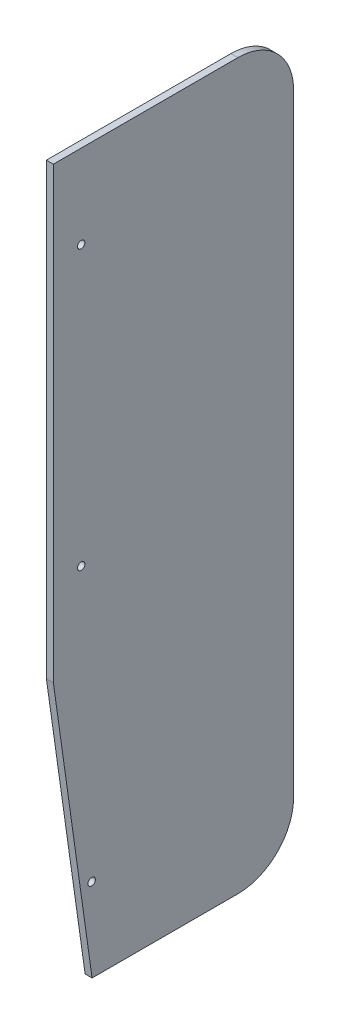
ISO-10303-21;
HEADER;
FILE_DESCRIPTION(('STEP AP214'),'2;1');
FILE_NAME('part.step','',(''),(''),'','','');
FILE_SCHEMA(('AUTOMOTIVE_DESIGN { 1 0 10303 214 1 1 1 1 }'));
ENDSEC;
DATA;
#1=APPLICATION_CONTEXT('core data for automotive mechanical design processes');
#2=APPLICATION_PROTOCOL_DEFINITION('international standard','automotive_design',2000,#1);
#3=PRODUCT_CONTEXT('',#1,'mechanical');
#4=PRODUCT('Part','Part','',(#3));
#5=PRODUCT_RELATED_PRODUCT_CATEGORY('part','',(#4));
#6=PRODUCT_DEFINITION_FORMATION('','',#4);
#7=PRODUCT_DEFINITION_CONTEXT('part definition',#1,'design');
#8=PRODUCT_DEFINITION('design','',#6,#7);
#9=PRODUCT_DEFINITION_SHAPE('','',#8);
#10=(LENGTH_UNIT() NAMED_UNIT(*) SI_UNIT(.MILLI.,.METRE.));
#11=(NAMED_UNIT(*) PLANE_ANGLE_UNIT() SI_UNIT($,.RADIAN.));
#12=(NAMED_UNIT(*) SI_UNIT($,.STERADIAN.) SOLID_ANGLE_UNIT());
#13=UNCERTAINTY_MEASURE_WITH_UNIT(LENGTH_MEASURE(1.E-05),#10,'distance_accuracy_value','');
#14=(GEOMETRIC_REPRESENTATION_CONTEXT(3) GLOBAL_UNCERTAINTY_ASSIGNED_CONTEXT((#13)) GLOBAL_UNIT_ASSIGNED_CONTEXT((#10,
#11,#12)) REPRESENTATION_CONTEXT('',''));
#15=CARTESIAN_POINT('',(0.,0.,0.));
#16=DIRECTION('',(0.,0.,1.));
#17=DIRECTION('',(1.,0.,0.));
#18=AXIS2_PLACEMENT_3D('',#15,#16,#17);
#19=CARTESIAN_POINT('',(0.,0.,0.));
#20=DIRECTION('',(1.,0.,0.));
#21=DIRECTION('',(0.,0.,-1.));
#22=AXIS2_PLACEMENT_3D('',#19,#20,#21);
#23=PLANE('',#22);
#24=CARTESIAN_POINT('',(0.,-76.2,-25.4));
#25=DIRECTION('',(1.,0.,0.));
#26=DIRECTION('',(0.,0.,-1.));
#27=AXIS2_PLACEMENT_3D('',#24,#25,#26);
#28=CIRCLE('',#27,3.3655);
#29=CARTESIAN_POINT('',(0.,-76.2,-28.7655));
#30=VERTEX_POINT('',#29);
#31=EDGE_CURVE('E144',#30,#30,#28,.T.);
#32=ORIENTED_EDGE('',*,*,#31,.T.);
#33=EDGE_LOOP('',(#32));
#34=FACE_BOUND('',#33,.T.);
#35=CARTESIAN_POINT('',(0.,-584.2,-34.925));
#36=DIRECTION('',(1.,0.,0.));
#37=DIRECTION('',(0.,0.,-1.));
#38=AXIS2_PLACEMENT_3D('',#35,#36,#37);
#39=CIRCLE('',#38,3.3655);
#40=CARTESIAN_POINT('',(0.,-584.2,-38.2905));
#41=VERTEX_POINT('',#40);
#42=EDGE_CURVE('E147',#41,#41,#39,.T.);
#43=ORIENTED_EDGE('',*,*,#42,.T.);
#44=EDGE_LOOP('',(#43));
#45=FACE_BOUND('',#44,.T.);
#46=CARTESIAN_POINT('',(0.,-330.2,-25.4));
#47=DIRECTION('',(1.,0.,0.));
#48=DIRECTION('',(0.,0.,-1.));
#49=AXIS2_PLACEMENT_3D('',#46,#47,#48);
#50=CIRCLE('',#49,3.3655);
#51=CARTESIAN_POINT('',(0.,-330.2,-28.7655));
#52=VERTEX_POINT('',#51);
#53=EDGE_CURVE('E121',#52,#52,#50,.T.);
#54=ORIENTED_EDGE('',*,*,#53,.T.);
#55=EDGE_LOOP('',(#54));
#56=FACE_BOUND('',#55,.T.);
#57=DIRECTION('',(0.,0.,1.));
#58=VECTOR('',#57,1.);
#59=CARTESIAN_POINT('',(0.,0.,-219.075));
#60=LINE('',#59,#58);
#61=CARTESIAN_POINT('',(0.,0.,-168.275));
#62=VERTEX_POINT('',#61);
#63=CARTESIAN_POINT('',(0.,0.,0.));
#64=VERTEX_POINT('',#63);
#65=EDGE_CURVE('E124',#62,#64,#60,.T.);
#66=ORIENTED_EDGE('',*,*,#65,.F.);
#67=CARTESIAN_POINT('',(0.,-50.8,-168.275));
#68=DIRECTION('',(-1.,0.,0.));
#69=DIRECTION('',(0.,0.,1.));
#70=AXIS2_PLACEMENT_3D('',#67,#68,#69);
#71=CIRCLE('',#70,50.8);
#72=CARTESIAN_POINT('',(0.,-50.8,-219.075));
#73=VERTEX_POINT('',#72);
#74=EDGE_CURVE('E81',#73,#62,#71,.F.);
#75=ORIENTED_EDGE('',*,*,#74,.F.);
#76=DIRECTION('',(0.,1.,0.));
#77=VECTOR('',#76,1.);
#78=CARTESIAN_POINT('',(0.,-660.4,-219.075));
#79=LINE('',#78,#77);
#80=CARTESIAN_POINT('',(0.,-609.6,-219.075));
#81=VERTEX_POINT('',#80);
#82=EDGE_CURVE('E77',#81,#73,#79,.T.);
#83=ORIENTED_EDGE('',*,*,#82,.F.);
#84=CARTESIAN_POINT('',(0.,-609.6,-168.275));
#85=DIRECTION('',(-1.,0.,0.));
#86=DIRECTION('',(0.,0.,1.));
#87=AXIS2_PLACEMENT_3D('',#84,#85,#86);
#88=CIRCLE('',#87,50.8);
#89=CARTESIAN_POINT('',(0.,-660.4,-168.275));
#90=VERTEX_POINT('',#89);
#91=EDGE_CURVE('E20',#90,#81,#88,.F.);
#92=ORIENTED_EDGE('',*,*,#91,.F.);
#93=DIRECTION('',(0.,0.,-1.));
#94=VECTOR('',#93,1.);
#95=CARTESIAN_POINT('',(0.,-660.4,0.));
#96=LINE('',#95,#94);
#97=CARTESIAN_POINT('',(0.,-660.4,-35.3059999999987));
#98=VERTEX_POINT('',#97);
#99=EDGE_CURVE('E72',#98,#90,#96,.T.);
#100=ORIENTED_EDGE('',*,*,#99,.F.);
#101=DIRECTION('',(0.,-0.990238204862478,-0.139385428329997));
#102=VECTOR('',#101,1.);
#103=CARTESIAN_POINT('',(0.,-534.9875,-17.653));
#104=LINE('',#103,#102);
#105=CARTESIAN_POINT('',(0.,-409.575,-3.92047505570758E-13));
#106=VERTEX_POINT('',#105);
#107=EDGE_CURVE('E118',#106,#98,#104,.T.);
#108=ORIENTED_EDGE('',*,*,#107,.F.);
#109=DIRECTION('',(0.,1.,0.));
#110=VECTOR('',#109,1.);
#111=CARTESIAN_POINT('',(0.,0.,0.));
#112=LINE('',#111,#110);
#113=EDGE_CURVE('E105',#64,#106,#112,.F.);
#114=ORIENTED_EDGE('',*,*,#113,.F.);
#115=EDGE_LOOP('',(#66,#75,#83,#92,#100,#108,#114));
#116=FACE_BOUND('',#115,.T.);
#117=ADVANCED_FACE('F17',(#34,#45,#56,#116),#23,.F.);
#118=CARTESIAN_POINT('',(0.,-660.4,0.));
#119=DIRECTION('',(0.,-1.,0.));
#120=DIRECTION('',(0.,0.,-1.));
#121=AXIS2_PLACEMENT_3D('',#118,#119,#120);
#122=PLANE('',#121);
#123=DIRECTION('',(0.,0.,-1.));
#124=VECTOR('',#123,1.);
#125=CARTESIAN_POINT('',(6.35,-660.4,0.));
#126=LINE('',#125,#124);
#127=CARTESIAN_POINT('',(6.35,-660.4,-35.3059999999995));
#128=VERTEX_POINT('',#127);
#129=CARTESIAN_POINT('',(6.35,-660.4,-168.275));
#130=VERTEX_POINT('',#129);
#131=EDGE_CURVE('E143',#128,#130,#126,.T.);
#132=ORIENTED_EDGE('',*,*,#131,.F.);
#133=DIRECTION('',(1.,0.,0.));
#134=VECTOR('',#133,1.);
#135=CARTESIAN_POINT('',(3.175,-660.4,-35.3059999999984));
#136=LINE('',#135,#134);
#137=EDGE_CURVE('E102',#98,#128,#136,.T.);
#138=ORIENTED_EDGE('',*,*,#137,.F.);
#139=ORIENTED_EDGE('',*,*,#99,.T.);
#140=DIRECTION('',(-1.,0.,0.));
#141=VECTOR('',#140,1.);
#142=CARTESIAN_POINT('',(68.07454,-660.4,-168.275));
#143=LINE('',#142,#141);
#144=EDGE_CURVE('E91',#130,#90,#143,.T.);
#145=ORIENTED_EDGE('',*,*,#144,.F.);
#146=EDGE_LOOP('',(#132,#138,#139,#145));
#147=FACE_BOUND('',#146,.T.);
#148=ADVANCED_FACE('F179',(#147),#122,.T.);
#149=CARTESIAN_POINT('',(68.07454,-609.6,-168.275));
#150=DIRECTION('',(-1.,0.,0.));
#151=DIRECTION('',(0.,0.,1.));
#152=AXIS2_PLACEMENT_3D('',#149,#150,#151);
#153=CYLINDRICAL_SURFACE('',#152,50.8);
#154=ORIENTED_EDGE('',*,*,#144,.T.);
#155=ORIENTED_EDGE('',*,*,#91,.T.);
#156=DIRECTION('',(-1.,0.,0.));
#157=VECTOR('',#156,1.);
#158=CARTESIAN_POINT('',(0.,-609.6,-219.075));
#159=LINE('',#158,#157);
#160=CARTESIAN_POINT('',(6.35,-609.6,-219.075));
#161=VERTEX_POINT('',#160);
#162=EDGE_CURVE('E85',#161,#81,#159,.T.);
#163=ORIENTED_EDGE('',*,*,#162,.F.);
#164=CARTESIAN_POINT('',(6.35,-609.6,-168.275));
#165=DIRECTION('',(-1.,0.,0.));
#166=DIRECTION('',(0.,0.,1.));
#167=AXIS2_PLACEMENT_3D('',#164,#165,#166);
#168=CIRCLE('',#167,50.8);
#169=EDGE_CURVE('E141',#130,#161,#168,.F.);
#170=ORIENTED_EDGE('',*,*,#169,.F.);
#171=EDGE_LOOP('',(#154,#155,#163,#170));
#172=FACE_BOUND('',#171,.T.);
#173=ADVANCED_FACE('F88',(#172),#153,.T.);
#174=CARTESIAN_POINT('',(0.,-660.4,-219.075));
#175=DIRECTION('',(0.,0.,-1.));
#176=DIRECTION('',(-1.,0.,0.));
#177=AXIS2_PLACEMENT_3D('',#174,#175,#176);
#178=PLANE('',#177);
#179=DIRECTION('',(0.,1.,0.));
#180=VECTOR('',#179,1.);
#181=CARTESIAN_POINT('',(6.35,0.,-219.075));
#182=LINE('',#181,#180);
#183=CARTESIAN_POINT('',(6.35,-50.8,-219.075));
#184=VERTEX_POINT('',#183);
#185=EDGE_CURVE('E94',#161,#184,#182,.T.);
#186=ORIENTED_EDGE('',*,*,#185,.F.);
#187=ORIENTED_EDGE('',*,*,#162,.T.);
#188=ORIENTED_EDGE('',*,*,#82,.T.);
#189=DIRECTION('',(-1.,0.,0.));
#190=VECTOR('',#189,1.);
#191=CARTESIAN_POINT('',(68.07454,-50.8,-219.075));
#192=LINE('',#191,#190);
#193=EDGE_CURVE('E96',#184,#73,#192,.T.);
#194=ORIENTED_EDGE('',*,*,#193,.F.);
#195=EDGE_LOOP('',(#186,#187,#188,#194));
#196=FACE_BOUND('',#195,.T.);
#197=ADVANCED_FACE('F92',(#196),#178,.T.);
#198=CARTESIAN_POINT('',(68.07454,-50.8,-168.275));
#199=DIRECTION('',(-1.,0.,0.));
#200=DIRECTION('',(0.,0.,1.));
#201=AXIS2_PLACEMENT_3D('',#198,#199,#200);
#202=CYLINDRICAL_SURFACE('',#201,50.8);
#203=ORIENTED_EDGE('',*,*,#193,.T.);
#204=ORIENTED_EDGE('',*,*,#74,.T.);
#205=DIRECTION('',(1.,0.,0.));
#206=VECTOR('',#205,1.);
#207=CARTESIAN_POINT('',(0.,0.,-168.275));
#208=LINE('',#207,#206);
#209=CARTESIAN_POINT('',(6.35,0.,-168.275));
#210=VERTEX_POINT('',#209);
#211=EDGE_CURVE('E126',#210,#62,#208,.F.);
#212=ORIENTED_EDGE('',*,*,#211,.F.);
#213=CARTESIAN_POINT('',(6.35,-50.8,-168.275));
#214=DIRECTION('',(-1.,0.,0.));
#215=DIRECTION('',(0.,0.,1.));
#216=AXIS2_PLACEMENT_3D('',#213,#214,#215);
#217=CIRCLE('',#216,50.8);
#218=EDGE_CURVE('E137',#184,#210,#217,.F.);
#219=ORIENTED_EDGE('',*,*,#218,.F.);
#220=EDGE_LOOP('',(#203,#204,#212,#219));
#221=FACE_BOUND('',#220,.T.);
#222=ADVANCED_FACE('F153',(#221),#202,.T.);
#223=CARTESIAN_POINT('',(0.,0.,-219.075));
#224=DIRECTION('',(0.,1.,0.));
#225=DIRECTION('',(0.,0.,1.));
#226=AXIS2_PLACEMENT_3D('',#223,#224,#225);
#227=PLANE('',#226);
#228=DIRECTION('',(0.,0.,-1.));
#229=VECTOR('',#228,1.);
#230=CARTESIAN_POINT('',(6.35,0.,0.));
#231=LINE('',#230,#229);
#232=CARTESIAN_POINT('',(6.35,0.,0.));
#233=VERTEX_POINT('',#232);
#234=EDGE_CURVE('E140',#210,#233,#231,.F.);
#235=ORIENTED_EDGE('',*,*,#234,.F.);
#236=ORIENTED_EDGE('',*,*,#211,.T.);
#237=ORIENTED_EDGE('',*,*,#65,.T.);
#238=DIRECTION('',(1.,0.,0.));
#239=VECTOR('',#238,1.);
#240=CARTESIAN_POINT('',(0.,0.,0.));
#241=LINE('',#240,#239);
#242=EDGE_CURVE('E130',#233,#64,#241,.F.);
#243=ORIENTED_EDGE('',*,*,#242,.F.);
#244=EDGE_LOOP('',(#235,#236,#237,#243));
#245=FACE_BOUND('',#244,.T.);
#246=ADVANCED_FACE('F157',(#245),#227,.T.);
#247=CARTESIAN_POINT('',(0.,0.,0.));
#248=DIRECTION('',(0.,0.,1.));
#249=DIRECTION('',(1.,0.,0.));
#250=AXIS2_PLACEMENT_3D('',#247,#248,#249);
#251=PLANE('',#250);
#252=ORIENTED_EDGE('',*,*,#113,.T.);
#253=DIRECTION('',(1.,0.,0.));
#254=VECTOR('',#253,1.);
#255=CARTESIAN_POINT('',(3.175,-409.575,-1.56819002228303E-12));
#256=LINE('',#255,#254);
#257=CARTESIAN_POINT('',(6.35,-409.574999999998,-2.64668181451968E-13));
#258=VERTEX_POINT('',#257);
#259=EDGE_CURVE('E35',#258,#106,#256,.F.);
#260=ORIENTED_EDGE('',*,*,#259,.F.);
#261=DIRECTION('',(0.,1.,0.));
#262=VECTOR('',#261,1.);
#263=CARTESIAN_POINT('',(6.35,0.,0.));
#264=LINE('',#263,#262);
#265=EDGE_CURVE('E112',#233,#258,#264,.F.);
#266=ORIENTED_EDGE('',*,*,#265,.F.);
#267=ORIENTED_EDGE('',*,*,#242,.T.);
#268=EDGE_LOOP('',(#252,#260,#266,#267));
#269=FACE_BOUND('',#268,.T.);
#270=ADVANCED_FACE('F183',(#269),#251,.T.);
#271=CARTESIAN_POINT('',(3.175,-534.9875,-17.653));
#272=DIRECTION('',(0.,-0.139385428329997,0.990238204862478));
#273=DIRECTION('',(0.,-0.990238204862478,-0.139385428329997));
#274=AXIS2_PLACEMENT_3D('',#271,#272,#273);
#275=PLANE('',#274);
#276=ORIENTED_EDGE('',*,*,#259,.T.);
#277=ORIENTED_EDGE('',*,*,#107,.T.);
#278=ORIENTED_EDGE('',*,*,#137,.T.);
#279=DIRECTION('',(0.,-0.990238204862477,-0.139385428330009));
#280=VECTOR('',#279,1.);
#281=CARTESIAN_POINT('',(6.35,-409.575,0.));
#282=LINE('',#281,#280);
#283=EDGE_CURVE('E108',#258,#128,#282,.T.);
#284=ORIENTED_EDGE('',*,*,#283,.F.);
#285=EDGE_LOOP('',(#276,#277,#278,#284));
#286=FACE_BOUND('',#285,.T.);
#287=ADVANCED_FACE('F181',(#286),#275,.T.);
#288=CARTESIAN_POINT('',(6.35,-330.2,-25.4));
#289=DIRECTION('',(1.,0.,0.));
#290=DIRECTION('',(0.,0.,-1.));
#291=AXIS2_PLACEMENT_3D('',#288,#289,#290);
#292=CYLINDRICAL_SURFACE('',#291,3.3655);
#293=CARTESIAN_POINT('',(6.35,-330.2,-25.4));
#294=DIRECTION('',(1.,0.,0.));
#295=DIRECTION('',(0.,0.,-1.));
#296=AXIS2_PLACEMENT_3D('',#293,#294,#295);
#297=CIRCLE('',#296,3.3655);
#298=CARTESIAN_POINT('',(6.35,-330.2,-28.7655));
#299=VERTEX_POINT('',#298);
#300=EDGE_CURVE('E111',#299,#299,#297,.F.);
#301=ORIENTED_EDGE('',*,*,#300,.F.);
#302=EDGE_LOOP('',(#301));
#303=FACE_BOUND('',#302,.T.);
#304=ORIENTED_EDGE('',*,*,#53,.F.);
#305=EDGE_LOOP('',(#304));
#306=FACE_BOUND('',#305,.T.);
#307=ADVANCED_FACE('F191',(#303,#306),#292,.F.);
#308=CARTESIAN_POINT('',(6.35,-584.2,-34.925));
#309=DIRECTION('',(1.,0.,0.));
#310=DIRECTION('',(0.,0.,-1.));
#311=AXIS2_PLACEMENT_3D('',#308,#309,#310);
#312=CYLINDRICAL_SURFACE('',#311,3.3655);
#313=CARTESIAN_POINT('',(6.35,-584.2,-34.925));
#314=DIRECTION('',(1.,0.,0.));
#315=DIRECTION('',(0.,0.,-1.));
#316=AXIS2_PLACEMENT_3D('',#313,#314,#315);
#317=CIRCLE('',#316,3.3655);
#318=CARTESIAN_POINT('',(6.35,-584.2,-38.2905));
#319=VERTEX_POINT('',#318);
#320=EDGE_CURVE('E26',#319,#319,#317,.F.);
#321=ORIENTED_EDGE('',*,*,#320,.F.);
#322=EDGE_LOOP('',(#321));
#323=FACE_BOUND('',#322,.T.);
#324=ORIENTED_EDGE('',*,*,#42,.F.);
#325=EDGE_LOOP('',(#324));
#326=FACE_BOUND('',#325,.T.);
#327=ADVANCED_FACE('F201',(#323,#326),#312,.F.);
#328=CARTESIAN_POINT('',(6.35,-76.2,-25.4));
#329=DIRECTION('',(1.,0.,0.));
#330=DIRECTION('',(0.,0.,-1.));
#331=AXIS2_PLACEMENT_3D('',#328,#329,#330);
#332=CYLINDRICAL_SURFACE('',#331,3.3655);
#333=CARTESIAN_POINT('',(6.35,-76.2,-25.4));
#334=DIRECTION('',(1.,0.,0.));
#335=DIRECTION('',(0.,0.,-1.));
#336=AXIS2_PLACEMENT_3D('',#333,#334,#335);
#337=CIRCLE('',#336,3.3655);
#338=CARTESIAN_POINT('',(6.35,-76.2,-28.7655));
#339=VERTEX_POINT('',#338);
#340=EDGE_CURVE('E11',#339,#339,#337,.F.);
#341=ORIENTED_EDGE('',*,*,#340,.F.);
#342=EDGE_LOOP('',(#341));
#343=FACE_BOUND('',#342,.T.);
#344=ORIENTED_EDGE('',*,*,#31,.F.);
#345=EDGE_LOOP('',(#344));
#346=FACE_BOUND('',#345,.T.);
#347=ADVANCED_FACE('F195',(#343,#346),#332,.F.);
#348=CARTESIAN_POINT('',(6.35,0.,0.));
#349=DIRECTION('',(1.,0.,0.));
#350=DIRECTION('',(0.,0.,-1.));
#351=AXIS2_PLACEMENT_3D('',#348,#349,#350);
#352=PLANE('',#351);
#353=ORIENTED_EDGE('',*,*,#340,.T.);
#354=EDGE_LOOP('',(#353));
#355=FACE_BOUND('',#354,.T.);
#356=ORIENTED_EDGE('',*,*,#320,.T.);
#357=EDGE_LOOP('',(#356));
#358=FACE_BOUND('',#357,.T.);
#359=ORIENTED_EDGE('',*,*,#300,.T.);
#360=EDGE_LOOP('',(#359));
#361=FACE_BOUND('',#360,.T.);
#362=ORIENTED_EDGE('',*,*,#265,.T.);
#363=ORIENTED_EDGE('',*,*,#283,.T.);
#364=ORIENTED_EDGE('',*,*,#131,.T.);
#365=ORIENTED_EDGE('',*,*,#169,.T.);
#366=ORIENTED_EDGE('',*,*,#185,.T.);
#367=ORIENTED_EDGE('',*,*,#218,.T.);
#368=ORIENTED_EDGE('',*,*,#234,.T.);
#369=EDGE_LOOP('',(#362,#363,#364,#365,#366,#367,#368));
#370=FACE_BOUND('',#369,.T.);
#371=ADVANCED_FACE('F178',(#355,#358,#361,#370),#352,.T.);
#372=CLOSED_SHELL('',(#117,#148,#173,#197,#222,#246,#270,#287,#307,#327,#347,#371));
#373=MANIFOLD_SOLID_BREP('B1',#372);
#374=ADVANCED_BREP_SHAPE_REPRESENTATION('',(#18,#373),#14);
#375=SHAPE_DEFINITION_REPRESENTATION(#9,#374);
ENDSEC;
END-ISO-10303-21;
